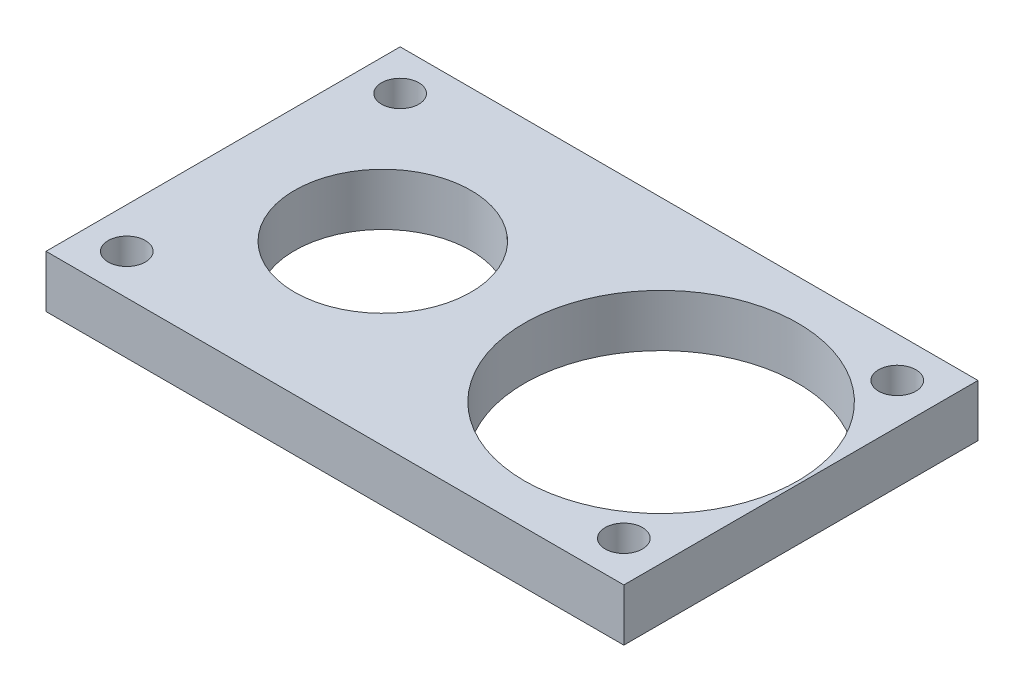
ISO-10303-21;
HEADER;
FILE_DESCRIPTION(('STEP AP214'),'2;1');
FILE_NAME('part.step','',(''),(''),'','','');
FILE_SCHEMA(('AUTOMOTIVE_DESIGN { 1 0 10303 214 1 1 1 1 }'));
ENDSEC;
DATA;
#1=APPLICATION_CONTEXT('core data for automotive mechanical design processes');
#2=APPLICATION_PROTOCOL_DEFINITION('international standard','automotive_design',2000,#1);
#3=PRODUCT_CONTEXT('',#1,'mechanical');
#4=PRODUCT('Part','Part','',(#3));
#5=PRODUCT_RELATED_PRODUCT_CATEGORY('part','',(#4));
#6=PRODUCT_DEFINITION_FORMATION('','',#4);
#7=PRODUCT_DEFINITION_CONTEXT('part definition',#1,'design');
#8=PRODUCT_DEFINITION('design','',#6,#7);
#9=PRODUCT_DEFINITION_SHAPE('','',#8);
#10=(LENGTH_UNIT() NAMED_UNIT(*) SI_UNIT(.MILLI.,.METRE.));
#11=(NAMED_UNIT(*) PLANE_ANGLE_UNIT() SI_UNIT($,.RADIAN.));
#12=(NAMED_UNIT(*) SI_UNIT($,.STERADIAN.) SOLID_ANGLE_UNIT());
#13=UNCERTAINTY_MEASURE_WITH_UNIT(LENGTH_MEASURE(1.E-05),#10,'distance_accuracy_value','');
#14=(GEOMETRIC_REPRESENTATION_CONTEXT(3) GLOBAL_UNCERTAINTY_ASSIGNED_CONTEXT((#13)) GLOBAL_UNIT_ASSIGNED_CONTEXT((#10,
#11,#12)) REPRESENTATION_CONTEXT('',''));
#15=CARTESIAN_POINT('',(0.,0.,0.));
#16=DIRECTION('',(0.,0.,1.));
#17=DIRECTION('',(1.,0.,0.));
#18=AXIS2_PLACEMENT_3D('',#15,#16,#17);
#19=CARTESIAN_POINT('',(-28.85,-4.2,-14.25));
#20=DIRECTION('',(-1.,0.,0.));
#21=DIRECTION('',(0.,0.,1.));
#22=AXIS2_PLACEMENT_3D('',#19,#20,#21);
#23=PLANE('',#22);
#24=DIRECTION('',(0.,0.,1.));
#25=VECTOR('',#24,1.);
#26=CARTESIAN_POINT('',(-28.85,0.,-14.25));
#27=LINE('',#26,#25);
#28=CARTESIAN_POINT('',(-28.85,0.,-14.25));
#29=VERTEX_POINT('',#28);
#30=CARTESIAN_POINT('',(-28.85,0.,14.25));
#31=VERTEX_POINT('',#30);
#32=EDGE_CURVE('E114',#29,#31,#27,.T.);
#33=ORIENTED_EDGE('',*,*,#32,.F.);
#34=DIRECTION('',(0.,1.,0.));
#35=VECTOR('',#34,1.);
#36=CARTESIAN_POINT('',(-28.85,-4.2,-14.25));
#37=LINE('',#36,#35);
#38=CARTESIAN_POINT('',(-28.85,-4.2,-14.25));
#39=VERTEX_POINT('',#38);
#40=EDGE_CURVE('E11',#39,#29,#37,.T.);
#41=ORIENTED_EDGE('',*,*,#40,.F.);
#42=DIRECTION('',(0.,0.,1.));
#43=VECTOR('',#42,1.);
#44=CARTESIAN_POINT('',(-28.85,-4.2,-14.25));
#45=LINE('',#44,#43);
#46=CARTESIAN_POINT('',(-28.85,-4.2,14.25));
#47=VERTEX_POINT('',#46);
#48=EDGE_CURVE('E105',#39,#47,#45,.T.);
#49=ORIENTED_EDGE('',*,*,#48,.T.);
#50=DIRECTION('',(0.,1.,0.));
#51=VECTOR('',#50,1.);
#52=CARTESIAN_POINT('',(-28.85,-4.2,14.25));
#53=LINE('',#52,#51);
#54=EDGE_CURVE('E46',#47,#31,#53,.T.);
#55=ORIENTED_EDGE('',*,*,#54,.T.);
#56=EDGE_LOOP('',(#33,#41,#49,#55));
#57=FACE_BOUND('',#56,.T.);
#58=ADVANCED_FACE('F43',(#57),#23,.T.);
#59=CARTESIAN_POINT('',(-28.85,-4.2,-14.25));
#60=DIRECTION('',(0.,0.,-1.));
#61=DIRECTION('',(-1.,0.,0.));
#62=AXIS2_PLACEMENT_3D('',#59,#60,#61);
#63=PLANE('',#62);
#64=DIRECTION('',(-1.,0.,0.));
#65=VECTOR('',#64,1.);
#66=CARTESIAN_POINT('',(-28.85,0.,-14.25));
#67=LINE('',#66,#65);
#68=CARTESIAN_POINT('',(17.65,0.,-14.25));
#69=VERTEX_POINT('',#68);
#70=EDGE_CURVE('E108',#69,#29,#67,.T.);
#71=ORIENTED_EDGE('',*,*,#70,.F.);
#72=DIRECTION('',(0.,1.,0.));
#73=VECTOR('',#72,1.);
#74=CARTESIAN_POINT('',(17.65,-4.2,-14.25));
#75=LINE('',#74,#73);
#76=CARTESIAN_POINT('',(17.65,-4.2,-14.25));
#77=VERTEX_POINT('',#76);
#78=EDGE_CURVE('E53',#77,#69,#75,.T.);
#79=ORIENTED_EDGE('',*,*,#78,.F.);
#80=DIRECTION('',(-1.,0.,0.));
#81=VECTOR('',#80,1.);
#82=CARTESIAN_POINT('',(-28.85,-4.2,-14.25));
#83=LINE('',#82,#81);
#84=EDGE_CURVE('E100',#77,#39,#83,.T.);
#85=ORIENTED_EDGE('',*,*,#84,.T.);
#86=ORIENTED_EDGE('',*,*,#40,.T.);
#87=EDGE_LOOP('',(#71,#79,#85,#86));
#88=FACE_BOUND('',#87,.T.);
#89=ADVANCED_FACE('F131',(#88),#63,.T.);
#90=CARTESIAN_POINT('',(17.65,-4.2,-14.25));
#91=DIRECTION('',(1.,0.,0.));
#92=DIRECTION('',(0.,0.,-1.));
#93=AXIS2_PLACEMENT_3D('',#90,#91,#92);
#94=PLANE('',#93);
#95=DIRECTION('',(0.,0.,-1.));
#96=VECTOR('',#95,1.);
#97=CARTESIAN_POINT('',(17.65,0.,-14.25));
#98=LINE('',#97,#96);
#99=CARTESIAN_POINT('',(17.65,0.,14.25));
#100=VERTEX_POINT('',#99);
#101=EDGE_CURVE('E94',#100,#69,#98,.T.);
#102=ORIENTED_EDGE('',*,*,#101,.F.);
#103=DIRECTION('',(0.,1.,0.));
#104=VECTOR('',#103,1.);
#105=CARTESIAN_POINT('',(17.65,-4.2,14.25));
#106=LINE('',#105,#104);
#107=CARTESIAN_POINT('',(17.65,-4.2,14.25));
#108=VERTEX_POINT('',#107);
#109=EDGE_CURVE('E89',#108,#100,#106,.T.);
#110=ORIENTED_EDGE('',*,*,#109,.F.);
#111=DIRECTION('',(0.,0.,-1.));
#112=VECTOR('',#111,1.);
#113=CARTESIAN_POINT('',(17.65,-4.2,-14.25));
#114=LINE('',#113,#112);
#115=EDGE_CURVE('E92',#108,#77,#114,.T.);
#116=ORIENTED_EDGE('',*,*,#115,.T.);
#117=ORIENTED_EDGE('',*,*,#78,.T.);
#118=EDGE_LOOP('',(#102,#110,#116,#117));
#119=FACE_BOUND('',#118,.T.);
#120=ADVANCED_FACE('F91',(#119),#94,.T.);
#121=CARTESIAN_POINT('',(-28.85,-4.2,14.25));
#122=DIRECTION('',(0.,0.,1.));
#123=DIRECTION('',(1.,0.,0.));
#124=AXIS2_PLACEMENT_3D('',#121,#122,#123);
#125=PLANE('',#124);
#126=DIRECTION('',(1.,0.,0.));
#127=VECTOR('',#126,1.);
#128=CARTESIAN_POINT('',(-28.85,0.,14.25));
#129=LINE('',#128,#127);
#130=EDGE_CURVE('E118',#31,#100,#129,.T.);
#131=ORIENTED_EDGE('',*,*,#130,.F.);
#132=ORIENTED_EDGE('',*,*,#54,.F.);
#133=DIRECTION('',(1.,0.,0.));
#134=VECTOR('',#133,1.);
#135=CARTESIAN_POINT('',(-28.85,-4.2,14.25));
#136=LINE('',#135,#134);
#137=EDGE_CURVE('E99',#47,#108,#136,.T.);
#138=ORIENTED_EDGE('',*,*,#137,.T.);
#139=ORIENTED_EDGE('',*,*,#109,.T.);
#140=EDGE_LOOP('',(#131,#132,#138,#139));
#141=FACE_BOUND('',#140,.T.);
#142=ADVANCED_FACE('F103',(#141),#125,.T.);
#143=CARTESIAN_POINT('',(0.,-4.2,0.));
#144=DIRECTION('',(0.,1.,0.));
#145=DIRECTION('',(0.,0.,1.));
#146=AXIS2_PLACEMENT_3D('',#143,#144,#145);
#147=PLANE('',#146);
#148=CARTESIAN_POINT('',(-16.,-4.2,0.));
#149=DIRECTION('',(0.,1.,0.));
#150=DIRECTION('',(0.,0.,1.));
#151=AXIS2_PLACEMENT_3D('',#148,#149,#150);
#152=CIRCLE('',#151,7.1);
#153=CARTESIAN_POINT('',(-16.,-4.2,7.1));
#154=VERTEX_POINT('',#153);
#155=EDGE_CURVE('E180',#154,#154,#152,.T.);
#156=ORIENTED_EDGE('',*,*,#155,.T.);
#157=EDGE_LOOP('',(#156));
#158=FACE_BOUND('',#157,.T.);
#159=CARTESIAN_POINT('',(6.4,-4.2,0.));
#160=DIRECTION('',(0.,1.,0.));
#161=DIRECTION('',(0.,0.,1.));
#162=AXIS2_PLACEMENT_3D('',#159,#160,#161);
#163=CIRCLE('',#162,11.);
#164=CARTESIAN_POINT('',(6.4,-4.2,11.));
#165=VERTEX_POINT('',#164);
#166=EDGE_CURVE('E190',#165,#165,#163,.T.);
#167=ORIENTED_EDGE('',*,*,#166,.T.);
#168=EDGE_LOOP('',(#167));
#169=FACE_BOUND('',#168,.T.);
#170=CARTESIAN_POINT('',(-25.6,-4.2,11.));
#171=DIRECTION('',(0.,1.,0.));
#172=DIRECTION('',(0.,0.,1.));
#173=AXIS2_PLACEMENT_3D('',#170,#171,#172);
#174=CIRCLE('',#173,1.5);
#175=CARTESIAN_POINT('',(-25.6,-4.2,12.5));
#176=VERTEX_POINT('',#175);
#177=EDGE_CURVE('E198',#176,#176,#174,.T.);
#178=ORIENTED_EDGE('',*,*,#177,.T.);
#179=EDGE_LOOP('',(#178));
#180=FACE_BOUND('',#179,.T.);
#181=CARTESIAN_POINT('',(14.4,-4.2,11.));
#182=DIRECTION('',(0.,1.,0.));
#183=DIRECTION('',(0.,0.,1.));
#184=AXIS2_PLACEMENT_3D('',#181,#182,#183);
#185=CIRCLE('',#184,1.5);
#186=CARTESIAN_POINT('',(14.4,-4.2,12.5));
#187=VERTEX_POINT('',#186);
#188=EDGE_CURVE('E206',#187,#187,#185,.T.);
#189=ORIENTED_EDGE('',*,*,#188,.T.);
#190=EDGE_LOOP('',(#189));
#191=FACE_BOUND('',#190,.T.);
#192=CARTESIAN_POINT('',(14.4,-4.2,-11.));
#193=DIRECTION('',(0.,1.,0.));
#194=DIRECTION('',(0.,0.,1.));
#195=AXIS2_PLACEMENT_3D('',#192,#193,#194);
#196=CIRCLE('',#195,1.5);
#197=CARTESIAN_POINT('',(14.4,-4.2,-9.5));
#198=VERTEX_POINT('',#197);
#199=EDGE_CURVE('E214',#198,#198,#196,.T.);
#200=ORIENTED_EDGE('',*,*,#199,.T.);
#201=EDGE_LOOP('',(#200));
#202=FACE_BOUND('',#201,.T.);
#203=CARTESIAN_POINT('',(-25.6,-4.2,-11.));
#204=DIRECTION('',(0.,1.,0.));
#205=DIRECTION('',(0.,0.,1.));
#206=AXIS2_PLACEMENT_3D('',#203,#204,#205);
#207=CIRCLE('',#206,1.5);
#208=CARTESIAN_POINT('',(-25.6,-4.2,-9.5));
#209=VERTEX_POINT('',#208);
#210=EDGE_CURVE('E119',#209,#209,#207,.T.);
#211=ORIENTED_EDGE('',*,*,#210,.T.);
#212=EDGE_LOOP('',(#211));
#213=FACE_BOUND('',#212,.T.);
#214=ORIENTED_EDGE('',*,*,#48,.F.);
#215=ORIENTED_EDGE('',*,*,#84,.F.);
#216=ORIENTED_EDGE('',*,*,#115,.F.);
#217=ORIENTED_EDGE('',*,*,#137,.F.);
#218=EDGE_LOOP('',(#214,#215,#216,#217));
#219=FACE_BOUND('',#218,.T.);
#220=ADVANCED_FACE('F98',(#158,#169,#180,#191,#202,#213,#219),#147,.F.);
#221=CARTESIAN_POINT('',(0.,0.,0.));
#222=DIRECTION('',(0.,1.,0.));
#223=DIRECTION('',(0.,0.,1.));
#224=AXIS2_PLACEMENT_3D('',#221,#222,#223);
#225=PLANE('',#224);
#226=CARTESIAN_POINT('',(-16.,0.,0.));
#227=DIRECTION('',(0.,1.,0.));
#228=DIRECTION('',(0.,0.,1.));
#229=AXIS2_PLACEMENT_3D('',#226,#227,#228);
#230=CIRCLE('',#229,7.1);
#231=CARTESIAN_POINT('',(-16.,0.,7.1));
#232=VERTEX_POINT('',#231);
#233=EDGE_CURVE('E183',#232,#232,#230,.T.);
#234=ORIENTED_EDGE('',*,*,#233,.F.);
#235=EDGE_LOOP('',(#234));
#236=FACE_BOUND('',#235,.T.);
#237=CARTESIAN_POINT('',(6.4,0.,0.));
#238=DIRECTION('',(0.,1.,0.));
#239=DIRECTION('',(0.,0.,1.));
#240=AXIS2_PLACEMENT_3D('',#237,#238,#239);
#241=CIRCLE('',#240,11.);
#242=CARTESIAN_POINT('',(6.4,0.,11.));
#243=VERTEX_POINT('',#242);
#244=EDGE_CURVE('E187',#243,#243,#241,.T.);
#245=ORIENTED_EDGE('',*,*,#244,.F.);
#246=EDGE_LOOP('',(#245));
#247=FACE_BOUND('',#246,.T.);
#248=CARTESIAN_POINT('',(-25.6,0.,11.));
#249=DIRECTION('',(0.,1.,0.));
#250=DIRECTION('',(0.,0.,1.));
#251=AXIS2_PLACEMENT_3D('',#248,#249,#250);
#252=CIRCLE('',#251,1.5);
#253=CARTESIAN_POINT('',(-25.6,0.,12.5));
#254=VERTEX_POINT('',#253);
#255=EDGE_CURVE('E194',#254,#254,#252,.T.);
#256=ORIENTED_EDGE('',*,*,#255,.F.);
#257=EDGE_LOOP('',(#256));
#258=FACE_BOUND('',#257,.T.);
#259=CARTESIAN_POINT('',(14.4,0.,11.));
#260=DIRECTION('',(0.,1.,0.));
#261=DIRECTION('',(0.,0.,1.));
#262=AXIS2_PLACEMENT_3D('',#259,#260,#261);
#263=CIRCLE('',#262,1.5);
#264=CARTESIAN_POINT('',(14.4,0.,12.5));
#265=VERTEX_POINT('',#264);
#266=EDGE_CURVE('E202',#265,#265,#263,.T.);
#267=ORIENTED_EDGE('',*,*,#266,.F.);
#268=EDGE_LOOP('',(#267));
#269=FACE_BOUND('',#268,.T.);
#270=CARTESIAN_POINT('',(14.4,0.,-11.));
#271=DIRECTION('',(0.,1.,0.));
#272=DIRECTION('',(0.,0.,1.));
#273=AXIS2_PLACEMENT_3D('',#270,#271,#272);
#274=CIRCLE('',#273,1.5);
#275=CARTESIAN_POINT('',(14.4,0.,-9.5));
#276=VERTEX_POINT('',#275);
#277=EDGE_CURVE('E210',#276,#276,#274,.T.);
#278=ORIENTED_EDGE('',*,*,#277,.F.);
#279=EDGE_LOOP('',(#278));
#280=FACE_BOUND('',#279,.T.);
#281=CARTESIAN_POINT('',(-25.6,0.,-11.));
#282=DIRECTION('',(0.,1.,0.));
#283=DIRECTION('',(0.,0.,1.));
#284=AXIS2_PLACEMENT_3D('',#281,#282,#283);
#285=CIRCLE('',#284,1.5);
#286=CARTESIAN_POINT('',(-25.6,0.,-9.5));
#287=VERTEX_POINT('',#286);
#288=EDGE_CURVE('E218',#287,#287,#285,.T.);
#289=ORIENTED_EDGE('',*,*,#288,.F.);
#290=EDGE_LOOP('',(#289));
#291=FACE_BOUND('',#290,.T.);
#292=ORIENTED_EDGE('',*,*,#32,.T.);
#293=ORIENTED_EDGE('',*,*,#130,.T.);
#294=ORIENTED_EDGE('',*,*,#101,.T.);
#295=ORIENTED_EDGE('',*,*,#70,.T.);
#296=EDGE_LOOP('',(#292,#293,#294,#295));
#297=FACE_BOUND('',#296,.T.);
#298=ADVANCED_FACE('F130',(#236,#247,#258,#269,#280,#291,#297),#225,.T.);
#299=CARTESIAN_POINT('',(-25.6,-4.2,-11.));
#300=DIRECTION('',(0.,1.,0.));
#301=DIRECTION('',(0.,0.,1.));
#302=AXIS2_PLACEMENT_3D('',#299,#300,#301);
#303=CYLINDRICAL_SURFACE('',#302,1.5);
#304=ORIENTED_EDGE('',*,*,#210,.F.);
#305=EDGE_LOOP('',(#304));
#306=FACE_BOUND('',#305,.T.);
#307=ORIENTED_EDGE('',*,*,#288,.T.);
#308=EDGE_LOOP('',(#307));
#309=FACE_BOUND('',#308,.T.);
#310=ADVANCED_FACE('F149',(#306,#309),#303,.F.);
#311=CARTESIAN_POINT('',(14.4,-4.2,-11.));
#312=DIRECTION('',(0.,1.,0.));
#313=DIRECTION('',(0.,0.,1.));
#314=AXIS2_PLACEMENT_3D('',#311,#312,#313);
#315=CYLINDRICAL_SURFACE('',#314,1.5);
#316=ORIENTED_EDGE('',*,*,#199,.F.);
#317=EDGE_LOOP('',(#316));
#318=FACE_BOUND('',#317,.T.);
#319=ORIENTED_EDGE('',*,*,#277,.T.);
#320=EDGE_LOOP('',(#319));
#321=FACE_BOUND('',#320,.T.);
#322=ADVANCED_FACE('F156',(#318,#321),#315,.F.);
#323=CARTESIAN_POINT('',(14.4,-4.2,11.));
#324=DIRECTION('',(0.,1.,0.));
#325=DIRECTION('',(0.,0.,1.));
#326=AXIS2_PLACEMENT_3D('',#323,#324,#325);
#327=CYLINDRICAL_SURFACE('',#326,1.5);
#328=ORIENTED_EDGE('',*,*,#188,.F.);
#329=EDGE_LOOP('',(#328));
#330=FACE_BOUND('',#329,.T.);
#331=ORIENTED_EDGE('',*,*,#266,.T.);
#332=EDGE_LOOP('',(#331));
#333=FACE_BOUND('',#332,.T.);
#334=ADVANCED_FACE('F160',(#330,#333),#327,.F.);
#335=CARTESIAN_POINT('',(-25.6,-4.2,11.));
#336=DIRECTION('',(0.,1.,0.));
#337=DIRECTION('',(0.,0.,1.));
#338=AXIS2_PLACEMENT_3D('',#335,#336,#337);
#339=CYLINDRICAL_SURFACE('',#338,1.5);
#340=ORIENTED_EDGE('',*,*,#177,.F.);
#341=EDGE_LOOP('',(#340));
#342=FACE_BOUND('',#341,.T.);
#343=ORIENTED_EDGE('',*,*,#255,.T.);
#344=EDGE_LOOP('',(#343));
#345=FACE_BOUND('',#344,.T.);
#346=ADVANCED_FACE('F164',(#342,#345),#339,.F.);
#347=CARTESIAN_POINT('',(6.4,-4.2,0.));
#348=DIRECTION('',(0.,1.,0.));
#349=DIRECTION('',(0.,0.,1.));
#350=AXIS2_PLACEMENT_3D('',#347,#348,#349);
#351=CYLINDRICAL_SURFACE('',#350,11.);
#352=ORIENTED_EDGE('',*,*,#166,.F.);
#353=EDGE_LOOP('',(#352));
#354=FACE_BOUND('',#353,.T.);
#355=ORIENTED_EDGE('',*,*,#244,.T.);
#356=EDGE_LOOP('',(#355));
#357=FACE_BOUND('',#356,.T.);
#358=ADVANCED_FACE('F168',(#354,#357),#351,.F.);
#359=CARTESIAN_POINT('',(-16.,-4.2,0.));
#360=DIRECTION('',(0.,1.,0.));
#361=DIRECTION('',(0.,0.,1.));
#362=AXIS2_PLACEMENT_3D('',#359,#360,#361);
#363=CYLINDRICAL_SURFACE('',#362,7.1);
#364=ORIENTED_EDGE('',*,*,#155,.F.);
#365=EDGE_LOOP('',(#364));
#366=FACE_BOUND('',#365,.T.);
#367=ORIENTED_EDGE('',*,*,#233,.T.);
#368=EDGE_LOOP('',(#367));
#369=FACE_BOUND('',#368,.T.);
#370=ADVANCED_FACE('F172',(#366,#369),#363,.F.);
#371=CLOSED_SHELL('',(#58,#89,#120,#142,#220,#298,#310,#322,#334,#346,#358,#370));
#372=MANIFOLD_SOLID_BREP('B2',#371);
#373=ADVANCED_BREP_SHAPE_REPRESENTATION('',(#18,#372),#14);
#374=SHAPE_DEFINITION_REPRESENTATION(#9,#373);
ENDSEC;
END-ISO-10303-21;
